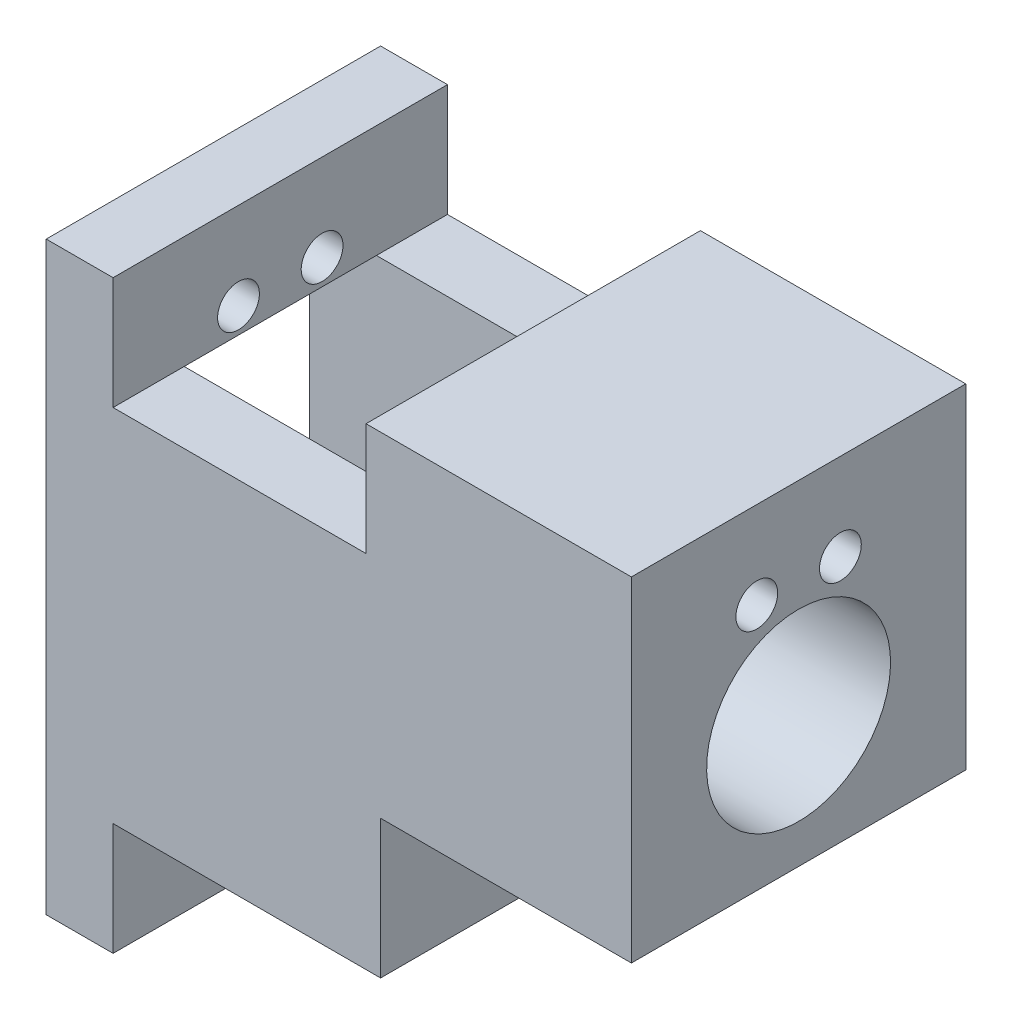
ISO-10303-21;
HEADER;
FILE_DESCRIPTION(('STEP AP214'),'2;1');
FILE_NAME('part.step','',(''),(''),'','','');
FILE_SCHEMA(('AUTOMOTIVE_DESIGN { 1 0 10303 214 1 1 1 1 }'));
ENDSEC;
DATA;
#1=APPLICATION_CONTEXT('core data for automotive mechanical design processes');
#2=APPLICATION_PROTOCOL_DEFINITION('international standard','automotive_design',2000,#1);
#3=PRODUCT_CONTEXT('',#1,'mechanical');
#4=PRODUCT('Part','Part','',(#3));
#5=PRODUCT_RELATED_PRODUCT_CATEGORY('part','',(#4));
#6=PRODUCT_DEFINITION_FORMATION('','',#4);
#7=PRODUCT_DEFINITION_CONTEXT('part definition',#1,'design');
#8=PRODUCT_DEFINITION('design','',#6,#7);
#9=PRODUCT_DEFINITION_SHAPE('','',#8);
#10=(LENGTH_UNIT() NAMED_UNIT(*) SI_UNIT(.MILLI.,.METRE.));
#11=(NAMED_UNIT(*) PLANE_ANGLE_UNIT() SI_UNIT($,.RADIAN.));
#12=(NAMED_UNIT(*) SI_UNIT($,.STERADIAN.) SOLID_ANGLE_UNIT());
#13=UNCERTAINTY_MEASURE_WITH_UNIT(LENGTH_MEASURE(1.E-05),#10,'distance_accuracy_value','');
#14=(GEOMETRIC_REPRESENTATION_CONTEXT(3) GLOBAL_UNCERTAINTY_ASSIGNED_CONTEXT((#13)) GLOBAL_UNIT_ASSIGNED_CONTEXT((#10,
#11,#12)) REPRESENTATION_CONTEXT('',''));
#15=CARTESIAN_POINT('',(0.,0.,0.));
#16=DIRECTION('',(0.,0.,1.));
#17=DIRECTION('',(1.,0.,0.));
#18=AXIS2_PLACEMENT_3D('',#15,#16,#17);
#19=CARTESIAN_POINT('',(-30.,-70.,40.));
#20=DIRECTION('',(-1.,0.,0.));
#21=DIRECTION('',(0.,0.,1.));
#22=AXIS2_PLACEMENT_3D('',#19,#20,#21);
#23=PLANE('',#22);
#24=DIRECTION('',(0.,0.,1.));
#25=VECTOR('',#24,1.);
#26=CARTESIAN_POINT('',(-30.,-56.55,0.));
#27=LINE('',#26,#25);
#28=CARTESIAN_POINT('',(-30.,-56.55,0.));
#29=VERTEX_POINT('',#28);
#30=CARTESIAN_POINT('',(-30.,-56.55,40.));
#31=VERTEX_POINT('',#30);
#32=EDGE_CURVE('E185',#29,#31,#27,.T.);
#33=ORIENTED_EDGE('',*,*,#32,.F.);
#34=DIRECTION('',(0.,1.,0.));
#35=VECTOR('',#34,1.);
#36=CARTESIAN_POINT('',(-30.,-70.,0.));
#37=LINE('',#36,#35);
#38=CARTESIAN_POINT('',(-30.,-40.,0.));
#39=VERTEX_POINT('',#38);
#40=EDGE_CURVE('E292',#29,#39,#37,.T.);
#41=ORIENTED_EDGE('',*,*,#40,.T.);
#42=DIRECTION('',(0.,0.,-1.));
#43=VECTOR('',#42,1.);
#44=CARTESIAN_POINT('',(-30.,-40.,40.));
#45=LINE('',#44,#43);
#46=CARTESIAN_POINT('',(-30.,-40.,40.));
#47=VERTEX_POINT('',#46);
#48=EDGE_CURVE('E297',#47,#39,#45,.T.);
#49=ORIENTED_EDGE('',*,*,#48,.F.);
#50=DIRECTION('',(0.,1.,0.));
#51=VECTOR('',#50,1.);
#52=CARTESIAN_POINT('',(-30.,-70.,40.));
#53=LINE('',#52,#51);
#54=EDGE_CURVE('E276',#31,#47,#53,.T.);
#55=ORIENTED_EDGE('',*,*,#54,.F.);
#56=EDGE_LOOP('',(#33,#41,#49,#55));
#57=FACE_BOUND('',#56,.T.);
#58=ADVANCED_FACE('F40',(#57),#23,.F.);
#59=CARTESIAN_POINT('',(-40.,0.,0.));
#60=DIRECTION('',(-1.,0.,0.));
#61=DIRECTION('',(0.,-1.,0.));
#62=AXIS2_PLACEMENT_3D('',#59,#60,#61);
#63=PLANE('',#62);
#64=DIRECTION('',(0.,1.,0.));
#65=VECTOR('',#64,1.);
#66=CARTESIAN_POINT('',(-40.,0.,8.5));
#67=LINE('',#66,#65);
#68=CARTESIAN_POINT('',(-40.,-56.55,8.5));
#69=VERTEX_POINT('',#68);
#70=CARTESIAN_POINT('',(-40.,-13.45,8.5));
#71=VERTEX_POINT('',#70);
#72=EDGE_CURVE('E241',#69,#71,#67,.T.);
#73=ORIENTED_EDGE('',*,*,#72,.F.);
#74=DIRECTION('',(0.,0.,1.));
#75=VECTOR('',#74,1.);
#76=CARTESIAN_POINT('',(-40.,-56.55,0.));
#77=LINE('',#76,#75);
#78=CARTESIAN_POINT('',(-40.,-56.55,31.5));
#79=VERTEX_POINT('',#78);
#80=EDGE_CURVE('E49',#69,#79,#77,.T.);
#81=ORIENTED_EDGE('',*,*,#80,.T.);
#82=DIRECTION('',(0.,1.,0.));
#83=VECTOR('',#82,1.);
#84=CARTESIAN_POINT('',(-40.,0.,31.5));
#85=LINE('',#84,#83);
#86=CARTESIAN_POINT('',(-40.,-13.45,31.5));
#87=VERTEX_POINT('',#86);
#88=EDGE_CURVE('E235',#79,#87,#85,.T.);
#89=ORIENTED_EDGE('',*,*,#88,.T.);
#90=DIRECTION('',(0.,0.,1.));
#91=VECTOR('',#90,1.);
#92=CARTESIAN_POINT('',(-40.,-13.45,0.));
#93=LINE('',#92,#91);
#94=EDGE_CURVE('E237',#71,#87,#93,.T.);
#95=ORIENTED_EDGE('',*,*,#94,.F.);
#96=EDGE_LOOP('',(#73,#81,#89,#95));
#97=FACE_BOUND('',#96,.T.);
#98=ADVANCED_FACE('F390',(#97),#63,.T.);
#99=CARTESIAN_POINT('',(0.,0.,40.));
#100=DIRECTION('',(0.,-1.,0.));
#101=DIRECTION('',(1.,0.,0.));
#102=AXIS2_PLACEMENT_3D('',#99,#100,#101);
#103=PLANE('',#102);
#104=DIRECTION('',(-1.,0.,0.));
#105=VECTOR('',#104,1.);
#106=CARTESIAN_POINT('',(0.,0.,40.));
#107=LINE('',#106,#105);
#108=CARTESIAN_POINT('',(-62.,0.,40.));
#109=VERTEX_POINT('',#108);
#110=CARTESIAN_POINT('',(-70.,0.,40.));
#111=VERTEX_POINT('',#110);
#112=EDGE_CURVE('E268',#109,#111,#107,.T.);
#113=ORIENTED_EDGE('',*,*,#112,.F.);
#114=DIRECTION('',(0.,0.,1.));
#115=VECTOR('',#114,1.);
#116=CARTESIAN_POINT('',(-62.,0.,0.));
#117=LINE('',#116,#115);
#118=CARTESIAN_POINT('',(-62.,0.,0.));
#119=VERTEX_POINT('',#118);
#120=EDGE_CURVE('E213',#119,#109,#117,.T.);
#121=ORIENTED_EDGE('',*,*,#120,.F.);
#122=DIRECTION('',(-1.,0.,0.));
#123=VECTOR('',#122,1.);
#124=CARTESIAN_POINT('',(0.,0.,0.));
#125=LINE('',#124,#123);
#126=CARTESIAN_POINT('',(-70.,0.,0.));
#127=VERTEX_POINT('',#126);
#128=EDGE_CURVE('E283',#119,#127,#125,.T.);
#129=ORIENTED_EDGE('',*,*,#128,.T.);
#130=DIRECTION('',(0.,0.,-1.));
#131=VECTOR('',#130,1.);
#132=CARTESIAN_POINT('',(-70.,0.,40.));
#133=LINE('',#132,#131);
#134=EDGE_CURVE('E303',#111,#127,#133,.T.);
#135=ORIENTED_EDGE('',*,*,#134,.F.);
#136=EDGE_LOOP('',(#113,#121,#129,#135));
#137=FACE_BOUND('',#136,.T.);
#138=ADVANCED_FACE('F356',(#137),#103,.F.);
#139=CARTESIAN_POINT('',(0.,-40.,40.));
#140=DIRECTION('',(-1.,0.,0.));
#141=DIRECTION('',(0.,-1.,0.));
#142=AXIS2_PLACEMENT_3D('',#139,#140,#141);
#143=PLANE('',#142);
#144=CARTESIAN_POINT('',(0.,-24.34,20.));
#145=DIRECTION('',(1.,0.,0.));
#146=DIRECTION('',(0.,1.,0.));
#147=AXIS2_PLACEMENT_3D('',#144,#145,#146);
#148=CIRCLE('',#147,11.);
#149=CARTESIAN_POINT('',(0.,-13.34,20.));
#150=VERTEX_POINT('',#149);
#151=EDGE_CURVE('E595',#150,#150,#148,.T.);
#152=ORIENTED_EDGE('',*,*,#151,.F.);
#153=EDGE_LOOP('',(#152));
#154=FACE_BOUND('',#153,.T.);
#155=CARTESIAN_POINT('',(0.,-10.4,15.));
#156=DIRECTION('',(-1.,0.,0.));
#157=DIRECTION('',(0.,-1.,0.));
#158=AXIS2_PLACEMENT_3D('',#155,#156,#157);
#159=CIRCLE('',#158,2.5);
#160=CARTESIAN_POINT('',(0.,-12.9,15.));
#161=VERTEX_POINT('',#160);
#162=EDGE_CURVE('E334',#161,#161,#159,.T.);
#163=ORIENTED_EDGE('',*,*,#162,.T.);
#164=EDGE_LOOP('',(#163));
#165=FACE_BOUND('',#164,.T.);
#166=CARTESIAN_POINT('',(0.,-10.4,25.));
#167=DIRECTION('',(-1.,0.,0.));
#168=DIRECTION('',(0.,-1.,0.));
#169=AXIS2_PLACEMENT_3D('',#166,#167,#168);
#170=CIRCLE('',#169,2.5);
#171=CARTESIAN_POINT('',(0.,-12.9,25.));
#172=VERTEX_POINT('',#171);
#173=EDGE_CURVE('E322',#172,#172,#170,.T.);
#174=ORIENTED_EDGE('',*,*,#173,.T.);
#175=EDGE_LOOP('',(#174));
#176=FACE_BOUND('',#175,.T.);
#177=DIRECTION('',(0.,1.,0.));
#178=VECTOR('',#177,1.);
#179=CARTESIAN_POINT('',(0.,-40.,0.));
#180=LINE('',#179,#178);
#181=CARTESIAN_POINT('',(0.,-40.,0.));
#182=VERTEX_POINT('',#181);
#183=CARTESIAN_POINT('',(0.,0.,0.));
#184=VERTEX_POINT('',#183);
#185=EDGE_CURVE('E256',#182,#184,#180,.T.);
#186=ORIENTED_EDGE('',*,*,#185,.T.);
#187=DIRECTION('',(0.,0.,-1.));
#188=VECTOR('',#187,1.);
#189=CARTESIAN_POINT('',(0.,0.,40.));
#190=LINE('',#189,#188);
#191=CARTESIAN_POINT('',(0.,0.,40.));
#192=VERTEX_POINT('',#191);
#193=EDGE_CURVE('E306',#192,#184,#190,.T.);
#194=ORIENTED_EDGE('',*,*,#193,.F.);
#195=DIRECTION('',(0.,1.,0.));
#196=VECTOR('',#195,1.);
#197=CARTESIAN_POINT('',(0.,-40.,40.));
#198=LINE('',#197,#196);
#199=CARTESIAN_POINT('',(0.,-40.,40.));
#200=VERTEX_POINT('',#199);
#201=EDGE_CURVE('E265',#200,#192,#198,.T.);
#202=ORIENTED_EDGE('',*,*,#201,.F.);
#203=DIRECTION('',(0.,0.,-1.));
#204=VECTOR('',#203,1.);
#205=CARTESIAN_POINT('',(0.,-40.,40.));
#206=LINE('',#205,#204);
#207=EDGE_CURVE('E280',#200,#182,#206,.T.);
#208=ORIENTED_EDGE('',*,*,#207,.T.);
#209=EDGE_LOOP('',(#186,#194,#202,#208));
#210=FACE_BOUND('',#209,.T.);
#211=ADVANCED_FACE('F42',(#154,#165,#176,#210),#143,.F.);
#212=CARTESIAN_POINT('',(-31.745166071012,0.,0.));
#213=VERTEX_POINT('',#212);
#214=EDGE_CURVE('E284',#184,#213,#125,.T.);
#215=ORIENTED_EDGE('',*,*,#214,.T.);
#216=DIRECTION('',(0.,0.,-1.));
#217=VECTOR('',#216,1.);
#218=CARTESIAN_POINT('',(-31.745166071012,0.,0.));
#219=LINE('',#218,#217);
#220=CARTESIAN_POINT('',(-31.745166071012,0.,40.));
#221=VERTEX_POINT('',#220);
#222=EDGE_CURVE('E208',#221,#213,#219,.T.);
#223=ORIENTED_EDGE('',*,*,#222,.F.);
#224=EDGE_CURVE('E270',#192,#221,#107,.T.);
#225=ORIENTED_EDGE('',*,*,#224,.F.);
#226=ORIENTED_EDGE('',*,*,#193,.T.);
#227=EDGE_LOOP('',(#215,#223,#225,#226));
#228=FACE_BOUND('',#227,.T.);
#229=ADVANCED_FACE('F406',(#228),#103,.F.);
#230=CARTESIAN_POINT('',(-70.,0.,40.));
#231=DIRECTION('',(1.,0.,0.));
#232=DIRECTION('',(0.,1.,0.));
#233=AXIS2_PLACEMENT_3D('',#230,#231,#232);
#234=PLANE('',#233);
#235=CARTESIAN_POINT('',(-70.,-10.4,15.));
#236=DIRECTION('',(-1.,0.,0.));
#237=DIRECTION('',(0.,-1.,0.));
#238=AXIS2_PLACEMENT_3D('',#235,#236,#237);
#239=CIRCLE('',#238,2.5);
#240=CARTESIAN_POINT('',(-70.,-12.9,15.));
#241=VERTEX_POINT('',#240);
#242=EDGE_CURVE('E603',#241,#241,#239,.T.);
#243=ORIENTED_EDGE('',*,*,#242,.F.);
#244=EDGE_LOOP('',(#243));
#245=FACE_BOUND('',#244,.T.);
#246=CARTESIAN_POINT('',(-70.,-60.5,25.));
#247=DIRECTION('',(-1.,0.,0.));
#248=DIRECTION('',(0.,-1.,0.));
#249=AXIS2_PLACEMENT_3D('',#246,#247,#248);
#250=CIRCLE('',#249,2.5);
#251=CARTESIAN_POINT('',(-70.,-63.,25.));
#252=VERTEX_POINT('',#251);
#253=EDGE_CURVE('E598',#252,#252,#250,.T.);
#254=ORIENTED_EDGE('',*,*,#253,.F.);
#255=EDGE_LOOP('',(#254));
#256=FACE_BOUND('',#255,.T.);
#257=CARTESIAN_POINT('',(-70.,-60.5,15.));
#258=DIRECTION('',(-1.,0.,0.));
#259=DIRECTION('',(0.,-1.,0.));
#260=AXIS2_PLACEMENT_3D('',#257,#258,#259);
#261=CIRCLE('',#260,2.5);
#262=CARTESIAN_POINT('',(-70.,-63.,15.));
#263=VERTEX_POINT('',#262);
#264=EDGE_CURVE('E594',#263,#263,#261,.T.);
#265=ORIENTED_EDGE('',*,*,#264,.F.);
#266=EDGE_LOOP('',(#265));
#267=FACE_BOUND('',#266,.T.);
#268=CARTESIAN_POINT('',(-70.,-10.4,25.));
#269=DIRECTION('',(-1.,0.,0.));
#270=DIRECTION('',(0.,-1.,0.));
#271=AXIS2_PLACEMENT_3D('',#268,#269,#270);
#272=CIRCLE('',#271,2.5);
#273=CARTESIAN_POINT('',(-70.,-12.9,25.));
#274=VERTEX_POINT('',#273);
#275=EDGE_CURVE('E314',#274,#274,#272,.T.);
#276=ORIENTED_EDGE('',*,*,#275,.F.);
#277=EDGE_LOOP('',(#276));
#278=FACE_BOUND('',#277,.T.);
#279=DIRECTION('',(0.,1.,0.));
#280=VECTOR('',#279,1.);
#281=CARTESIAN_POINT('',(-70.,0.,31.5));
#282=LINE('',#281,#280);
#283=CARTESIAN_POINT('',(-70.,-57.45,31.5));
#284=VERTEX_POINT('',#283);
#285=CARTESIAN_POINT('',(-70.,-13.45,31.5));
#286=VERTEX_POINT('',#285);
#287=EDGE_CURVE('E246',#284,#286,#282,.T.);
#288=ORIENTED_EDGE('',*,*,#287,.F.);
#289=DIRECTION('',(0.,0.,1.));
#290=VECTOR('',#289,1.);
#291=CARTESIAN_POINT('',(-70.,-57.45,0.));
#292=LINE('',#291,#290);
#293=CARTESIAN_POINT('',(-70.,-57.45,8.5));
#294=VERTEX_POINT('',#293);
#295=EDGE_CURVE('E228',#294,#284,#292,.T.);
#296=ORIENTED_EDGE('',*,*,#295,.F.);
#297=DIRECTION('',(0.,1.,0.));
#298=VECTOR('',#297,1.);
#299=CARTESIAN_POINT('',(-70.,0.,8.5));
#300=LINE('',#299,#298);
#301=CARTESIAN_POINT('',(-70.,-13.45,8.5));
#302=VERTEX_POINT('',#301);
#303=EDGE_CURVE('E238',#294,#302,#300,.T.);
#304=ORIENTED_EDGE('',*,*,#303,.T.);
#305=DIRECTION('',(0.,0.,1.));
#306=VECTOR('',#305,1.);
#307=CARTESIAN_POINT('',(-70.,-13.45,0.));
#308=LINE('',#307,#306);
#309=EDGE_CURVE('E249',#302,#286,#308,.T.);
#310=ORIENTED_EDGE('',*,*,#309,.T.);
#311=EDGE_LOOP('',(#288,#296,#304,#310));
#312=FACE_BOUND('',#311,.T.);
#313=DIRECTION('',(0.,-1.,0.));
#314=VECTOR('',#313,1.);
#315=CARTESIAN_POINT('',(-70.,0.,0.));
#316=LINE('',#315,#314);
#317=CARTESIAN_POINT('',(-70.,-70.,0.));
#318=VERTEX_POINT('',#317);
#319=EDGE_CURVE('E287',#127,#318,#316,.T.);
#320=ORIENTED_EDGE('',*,*,#319,.T.);
#321=DIRECTION('',(0.,0.,-1.));
#322=VECTOR('',#321,1.);
#323=CARTESIAN_POINT('',(-70.,-70.,40.));
#324=LINE('',#323,#322);
#325=CARTESIAN_POINT('',(-70.,-70.,40.));
#326=VERTEX_POINT('',#325);
#327=EDGE_CURVE('E300',#326,#318,#324,.T.);
#328=ORIENTED_EDGE('',*,*,#327,.F.);
#329=DIRECTION('',(0.,-1.,0.));
#330=VECTOR('',#329,1.);
#331=CARTESIAN_POINT('',(-70.,0.,40.));
#332=LINE('',#331,#330);
#333=EDGE_CURVE('E273',#111,#326,#332,.T.);
#334=ORIENTED_EDGE('',*,*,#333,.F.);
#335=ORIENTED_EDGE('',*,*,#134,.T.);
#336=EDGE_LOOP('',(#320,#328,#334,#335));
#337=FACE_BOUND('',#336,.T.);
#338=ADVANCED_FACE('F348',(#245,#256,#267,#278,#312,#337),#234,.F.);
#339=CARTESIAN_POINT('',(-70.,-70.,40.));
#340=DIRECTION('',(0.,1.,0.));
#341=DIRECTION('',(-1.,0.,0.));
#342=AXIS2_PLACEMENT_3D('',#339,#340,#341);
#343=PLANE('',#342);
#344=DIRECTION('',(1.,0.,0.));
#345=VECTOR('',#344,1.);
#346=CARTESIAN_POINT('',(-70.,-70.,0.));
#347=LINE('',#346,#345);
#348=CARTESIAN_POINT('',(-62.,-70.,0.));
#349=VERTEX_POINT('',#348);
#350=EDGE_CURVE('E289',#318,#349,#347,.T.);
#351=ORIENTED_EDGE('',*,*,#350,.T.);
#352=DIRECTION('',(0.,0.,-1.));
#353=VECTOR('',#352,1.);
#354=CARTESIAN_POINT('',(-62.,-70.,0.));
#355=LINE('',#354,#353);
#356=CARTESIAN_POINT('',(-62.,-70.,40.));
#357=VERTEX_POINT('',#356);
#358=EDGE_CURVE('E188',#357,#349,#355,.T.);
#359=ORIENTED_EDGE('',*,*,#358,.F.);
#360=DIRECTION('',(1.,0.,0.));
#361=VECTOR('',#360,1.);
#362=CARTESIAN_POINT('',(-70.,-70.,40.));
#363=LINE('',#362,#361);
#364=EDGE_CURVE('E193',#326,#357,#363,.T.);
#365=ORIENTED_EDGE('',*,*,#364,.F.);
#366=ORIENTED_EDGE('',*,*,#327,.T.);
#367=EDGE_LOOP('',(#351,#359,#365,#366));
#368=FACE_BOUND('',#367,.T.);
#369=ADVANCED_FACE('F344',(#368),#343,.F.);
#370=CARTESIAN_POINT('',(-30.,-40.,40.));
#371=DIRECTION('',(0.,1.,0.));
#372=DIRECTION('',(-1.,0.,0.));
#373=AXIS2_PLACEMENT_3D('',#370,#371,#372);
#374=PLANE('',#373);
#375=DIRECTION('',(1.,0.,0.));
#376=VECTOR('',#375,1.);
#377=CARTESIAN_POINT('',(-30.,-40.,0.));
#378=LINE('',#377,#376);
#379=EDGE_CURVE('E269',#39,#182,#378,.T.);
#380=ORIENTED_EDGE('',*,*,#379,.T.);
#381=ORIENTED_EDGE('',*,*,#207,.F.);
#382=DIRECTION('',(1.,0.,0.));
#383=VECTOR('',#382,1.);
#384=CARTESIAN_POINT('',(-30.,-40.,40.));
#385=LINE('',#384,#383);
#386=EDGE_CURVE('E278',#47,#200,#385,.T.);
#387=ORIENTED_EDGE('',*,*,#386,.F.);
#388=ORIENTED_EDGE('',*,*,#48,.T.);
#389=EDGE_LOOP('',(#380,#381,#387,#388));
#390=FACE_BOUND('',#389,.T.);
#391=ADVANCED_FACE('F399',(#390),#374,.F.);
#392=CARTESIAN_POINT('',(0.,0.,40.));
#393=DIRECTION('',(0.,0.,1.));
#394=DIRECTION('',(1.,0.,0.));
#395=AXIS2_PLACEMENT_3D('',#392,#393,#394);
#396=PLANE('',#395);
#397=DIRECTION('',(0.,-1.,0.));
#398=VECTOR('',#397,1.);
#399=CARTESIAN_POINT('',(-62.,-56.55,40.));
#400=LINE('',#399,#398);
#401=CARTESIAN_POINT('',(-62.,-56.55,40.));
#402=VERTEX_POINT('',#401);
#403=EDGE_CURVE('E176',#402,#357,#400,.T.);
#404=ORIENTED_EDGE('',*,*,#403,.F.);
#405=DIRECTION('',(-1.,0.,0.));
#406=VECTOR('',#405,1.);
#407=CARTESIAN_POINT('',(0.,-56.5499999999999,40.));
#408=LINE('',#407,#406);
#409=EDGE_CURVE('E182',#31,#402,#408,.T.);
#410=ORIENTED_EDGE('',*,*,#409,.F.);
#411=ORIENTED_EDGE('',*,*,#54,.T.);
#412=ORIENTED_EDGE('',*,*,#386,.T.);
#413=ORIENTED_EDGE('',*,*,#201,.T.);
#414=ORIENTED_EDGE('',*,*,#224,.T.);
#415=DIRECTION('',(0.,1.,0.));
#416=VECTOR('',#415,1.);
#417=CARTESIAN_POINT('',(-31.745166071012,-13.45,40.));
#418=LINE('',#417,#416);
#419=CARTESIAN_POINT('',(-31.745166071012,-13.45,40.));
#420=VERTEX_POINT('',#419);
#421=EDGE_CURVE('E221',#420,#221,#418,.T.);
#422=ORIENTED_EDGE('',*,*,#421,.F.);
#423=DIRECTION('',(1.,0.,0.));
#424=VECTOR('',#423,1.);
#425=CARTESIAN_POINT('',(0.,-13.45,40.));
#426=LINE('',#425,#424);
#427=CARTESIAN_POINT('',(-62.,-13.45,40.));
#428=VERTEX_POINT('',#427);
#429=EDGE_CURVE('E209',#428,#420,#426,.T.);
#430=ORIENTED_EDGE('',*,*,#429,.F.);
#431=DIRECTION('',(0.,1.,0.));
#432=VECTOR('',#431,1.);
#433=CARTESIAN_POINT('',(-62.,-13.45,40.));
#434=LINE('',#433,#432);
#435=EDGE_CURVE('E225',#428,#109,#434,.T.);
#436=ORIENTED_EDGE('',*,*,#435,.T.);
#437=ORIENTED_EDGE('',*,*,#112,.T.);
#438=ORIENTED_EDGE('',*,*,#333,.T.);
#439=ORIENTED_EDGE('',*,*,#364,.T.);
#440=EDGE_LOOP('',(#404,#410,#411,#412,#413,#414,#422,#430,#436,#437,#438,#439));
#441=FACE_BOUND('',#440,.T.);
#442=ADVANCED_FACE('F191',(#441),#396,.T.);
#443=CARTESIAN_POINT('',(0.,0.,0.));
#444=DIRECTION('',(0.,0.,1.));
#445=DIRECTION('',(1.,0.,0.));
#446=AXIS2_PLACEMENT_3D('',#443,#444,#445);
#447=PLANE('',#446);
#448=DIRECTION('',(1.,0.,0.));
#449=VECTOR('',#448,1.);
#450=CARTESIAN_POINT('',(0.,-56.5499999999999,0.));
#451=LINE('',#450,#449);
#452=CARTESIAN_POINT('',(-62.,-56.55,0.));
#453=VERTEX_POINT('',#452);
#454=EDGE_CURVE('E178',#453,#29,#451,.T.);
#455=ORIENTED_EDGE('',*,*,#454,.F.);
#456=DIRECTION('',(0.,-1.,0.));
#457=VECTOR('',#456,1.);
#458=CARTESIAN_POINT('',(-62.,-56.55,0.));
#459=LINE('',#458,#457);
#460=EDGE_CURVE('E57',#453,#349,#459,.T.);
#461=ORIENTED_EDGE('',*,*,#460,.T.);
#462=ORIENTED_EDGE('',*,*,#350,.F.);
#463=ORIENTED_EDGE('',*,*,#319,.F.);
#464=ORIENTED_EDGE('',*,*,#128,.F.);
#465=DIRECTION('',(0.,1.,0.));
#466=VECTOR('',#465,1.);
#467=CARTESIAN_POINT('',(-62.,-13.45,0.));
#468=LINE('',#467,#466);
#469=CARTESIAN_POINT('',(-62.,-13.45,0.));
#470=VERTEX_POINT('',#469);
#471=EDGE_CURVE('E229',#470,#119,#468,.T.);
#472=ORIENTED_EDGE('',*,*,#471,.F.);
#473=DIRECTION('',(-1.,0.,0.));
#474=VECTOR('',#473,1.);
#475=CARTESIAN_POINT('',(0.,-13.45,0.));
#476=LINE('',#475,#474);
#477=CARTESIAN_POINT('',(-31.745166071012,-13.45,0.));
#478=VERTEX_POINT('',#477);
#479=EDGE_CURVE('E215',#478,#470,#476,.T.);
#480=ORIENTED_EDGE('',*,*,#479,.F.);
#481=DIRECTION('',(0.,1.,0.));
#482=VECTOR('',#481,1.);
#483=CARTESIAN_POINT('',(-31.745166071012,-13.45,0.));
#484=LINE('',#483,#482);
#485=EDGE_CURVE('E231',#478,#213,#484,.T.);
#486=ORIENTED_EDGE('',*,*,#485,.T.);
#487=ORIENTED_EDGE('',*,*,#214,.F.);
#488=ORIENTED_EDGE('',*,*,#185,.F.);
#489=ORIENTED_EDGE('',*,*,#379,.F.);
#490=ORIENTED_EDGE('',*,*,#40,.F.);
#491=EDGE_LOOP('',(#455,#461,#462,#463,#464,#472,#480,#486,#487,#488,#489,#490));
#492=FACE_BOUND('',#491,.T.);
#493=ADVANCED_FACE('F341',(#492),#447,.F.);
#494=CARTESIAN_POINT('',(-40.,-57.45,0.));
#495=DIRECTION('',(0.,-1.,0.));
#496=DIRECTION('',(1.,0.,0.));
#497=AXIS2_PLACEMENT_3D('',#494,#495,#496);
#498=PLANE('',#497);
#499=DIRECTION('',(-1.,0.,0.));
#500=VECTOR('',#499,1.);
#501=CARTESIAN_POINT('',(-40.,-57.45,31.5));
#502=LINE('',#501,#500);
#503=CARTESIAN_POINT('',(-62.,-57.45,31.5));
#504=VERTEX_POINT('',#503);
#505=EDGE_CURVE('E243',#504,#284,#502,.T.);
#506=ORIENTED_EDGE('',*,*,#505,.F.);
#507=DIRECTION('',(0.,0.,-1.));
#508=VECTOR('',#507,1.);
#509=CARTESIAN_POINT('',(-62.,-57.45,0.));
#510=LINE('',#509,#508);
#511=CARTESIAN_POINT('',(-62.,-57.45,8.5));
#512=VERTEX_POINT('',#511);
#513=EDGE_CURVE('E203',#504,#512,#510,.T.);
#514=ORIENTED_EDGE('',*,*,#513,.T.);
#515=DIRECTION('',(-1.,0.,0.));
#516=VECTOR('',#515,1.);
#517=CARTESIAN_POINT('',(-40.,-57.45,8.5));
#518=LINE('',#517,#516);
#519=EDGE_CURVE('E254',#512,#294,#518,.T.);
#520=ORIENTED_EDGE('',*,*,#519,.T.);
#521=ORIENTED_EDGE('',*,*,#295,.T.);
#522=EDGE_LOOP('',(#506,#514,#520,#521));
#523=FACE_BOUND('',#522,.T.);
#524=ADVANCED_FACE('F392',(#523),#498,.F.);
#525=CARTESIAN_POINT('',(-40.,0.,8.5));
#526=DIRECTION('',(0.,0.,1.));
#527=DIRECTION('',(1.,0.,0.));
#528=AXIS2_PLACEMENT_3D('',#525,#526,#527);
#529=PLANE('',#528);
#530=DIRECTION('',(0.,-1.,0.));
#531=VECTOR('',#530,1.);
#532=CARTESIAN_POINT('',(-62.0000000000001,0.,8.5));
#533=LINE('',#532,#531);
#534=CARTESIAN_POINT('',(-62.,-56.55,8.5));
#535=VERTEX_POINT('',#534);
#536=EDGE_CURVE('E206',#535,#512,#533,.T.);
#537=ORIENTED_EDGE('',*,*,#536,.F.);
#538=DIRECTION('',(1.,0.,0.));
#539=VECTOR('',#538,1.);
#540=CARTESIAN_POINT('',(-40.,-56.55,8.5));
#541=LINE('',#540,#539);
#542=EDGE_CURVE('E200',#535,#69,#541,.T.);
#543=ORIENTED_EDGE('',*,*,#542,.T.);
#544=ORIENTED_EDGE('',*,*,#72,.T.);
#545=DIRECTION('',(-1.,0.,0.));
#546=VECTOR('',#545,1.);
#547=CARTESIAN_POINT('',(-40.,-13.45,8.5));
#548=LINE('',#547,#546);
#549=CARTESIAN_POINT('',(-62.,-13.45,8.5));
#550=VERTEX_POINT('',#549);
#551=EDGE_CURVE('E257',#71,#550,#548,.T.);
#552=ORIENTED_EDGE('',*,*,#551,.T.);
#553=EDGE_CURVE('E260',#550,#302,#548,.T.);
#554=ORIENTED_EDGE('',*,*,#553,.T.);
#555=ORIENTED_EDGE('',*,*,#303,.F.);
#556=ORIENTED_EDGE('',*,*,#519,.F.);
#557=EDGE_LOOP('',(#537,#543,#544,#552,#554,#555,#556));
#558=FACE_BOUND('',#557,.T.);
#559=ADVANCED_FACE('F385',(#558),#529,.T.);
#560=CARTESIAN_POINT('',(-40.,-13.45,0.));
#561=DIRECTION('',(0.,-1.,0.));
#562=DIRECTION('',(1.,0.,0.));
#563=AXIS2_PLACEMENT_3D('',#560,#561,#562);
#564=PLANE('',#563);
#565=DIRECTION('',(0.,0.,1.));
#566=VECTOR('',#565,1.);
#567=CARTESIAN_POINT('',(-62.,-13.45,0.));
#568=LINE('',#567,#566);
#569=CARTESIAN_POINT('',(-62.,-13.45,31.5));
#570=VERTEX_POINT('',#569);
#571=EDGE_CURVE('E222',#550,#570,#568,.T.);
#572=ORIENTED_EDGE('',*,*,#571,.T.);
#573=DIRECTION('',(-1.,0.,0.));
#574=VECTOR('',#573,1.);
#575=CARTESIAN_POINT('',(-40.,-13.45,31.5));
#576=LINE('',#575,#574);
#577=EDGE_CURVE('E263',#570,#286,#576,.T.);
#578=ORIENTED_EDGE('',*,*,#577,.T.);
#579=ORIENTED_EDGE('',*,*,#309,.F.);
#580=ORIENTED_EDGE('',*,*,#553,.F.);
#581=EDGE_LOOP('',(#572,#578,#579,#580));
#582=FACE_BOUND('',#581,.T.);
#583=ADVANCED_FACE('F372',(#582),#564,.T.);
#584=CARTESIAN_POINT('',(-40.,0.,31.5));
#585=DIRECTION('',(0.,0.,1.));
#586=DIRECTION('',(1.,0.,0.));
#587=AXIS2_PLACEMENT_3D('',#584,#585,#586);
#588=PLANE('',#587);
#589=DIRECTION('',(1.,0.,0.));
#590=VECTOR('',#589,1.);
#591=CARTESIAN_POINT('',(-40.,-56.55,31.5));
#592=LINE('',#591,#590);
#593=CARTESIAN_POINT('',(-62.,-56.55,31.5));
#594=VERTEX_POINT('',#593);
#595=EDGE_CURVE('E65',#594,#79,#592,.T.);
#596=ORIENTED_EDGE('',*,*,#595,.F.);
#597=DIRECTION('',(0.,-1.,0.));
#598=VECTOR('',#597,1.);
#599=CARTESIAN_POINT('',(-62.0000000000001,0.,31.5));
#600=LINE('',#599,#598);
#601=EDGE_CURVE('E12',#594,#504,#600,.T.);
#602=ORIENTED_EDGE('',*,*,#601,.T.);
#603=ORIENTED_EDGE('',*,*,#505,.T.);
#604=ORIENTED_EDGE('',*,*,#287,.T.);
#605=ORIENTED_EDGE('',*,*,#577,.F.);
#606=EDGE_CURVE('E261',#87,#570,#576,.T.);
#607=ORIENTED_EDGE('',*,*,#606,.F.);
#608=ORIENTED_EDGE('',*,*,#88,.F.);
#609=EDGE_LOOP('',(#596,#602,#603,#604,#605,#607,#608));
#610=FACE_BOUND('',#609,.T.);
#611=ADVANCED_FACE('F375',(#610),#588,.F.);
#612=CARTESIAN_POINT('',(-62.,-13.45,0.));
#613=DIRECTION('',(-1.,0.,0.));
#614=DIRECTION('',(0.,-1.,0.));
#615=AXIS2_PLACEMENT_3D('',#612,#613,#614);
#616=PLANE('',#615);
#617=CARTESIAN_POINT('',(-62.,-10.4,15.));
#618=DIRECTION('',(-1.,0.,0.));
#619=DIRECTION('',(0.,-1.,0.));
#620=AXIS2_PLACEMENT_3D('',#617,#618,#619);
#621=CIRCLE('',#620,2.5);
#622=CARTESIAN_POINT('',(-62.,-12.9,15.));
#623=VERTEX_POINT('',#622);
#624=EDGE_CURVE('E331',#623,#623,#621,.T.);
#625=ORIENTED_EDGE('',*,*,#624,.T.);
#626=EDGE_LOOP('',(#625));
#627=FACE_BOUND('',#626,.T.);
#628=CARTESIAN_POINT('',(-62.,-10.4,25.));
#629=DIRECTION('',(-1.,0.,0.));
#630=DIRECTION('',(0.,-1.,0.));
#631=AXIS2_PLACEMENT_3D('',#628,#629,#630);
#632=CIRCLE('',#631,2.5);
#633=CARTESIAN_POINT('',(-62.,-12.9,25.));
#634=VERTEX_POINT('',#633);
#635=EDGE_CURVE('E318',#634,#634,#632,.T.);
#636=ORIENTED_EDGE('',*,*,#635,.T.);
#637=EDGE_LOOP('',(#636));
#638=FACE_BOUND('',#637,.T.);
#639=ORIENTED_EDGE('',*,*,#120,.T.);
#640=ORIENTED_EDGE('',*,*,#435,.F.);
#641=EDGE_CURVE('E217',#570,#428,#568,.T.);
#642=ORIENTED_EDGE('',*,*,#641,.F.);
#643=ORIENTED_EDGE('',*,*,#571,.F.);
#644=EDGE_CURVE('E218',#470,#550,#568,.T.);
#645=ORIENTED_EDGE('',*,*,#644,.F.);
#646=ORIENTED_EDGE('',*,*,#471,.T.);
#647=EDGE_LOOP('',(#639,#640,#642,#643,#645,#646));
#648=FACE_BOUND('',#647,.T.);
#649=ADVANCED_FACE('F359',(#627,#638,#648),#616,.F.);
#650=CARTESIAN_POINT('',(-31.745166071012,-13.45,0.));
#651=DIRECTION('',(1.,0.,0.));
#652=DIRECTION('',(0.,1.,0.));
#653=AXIS2_PLACEMENT_3D('',#650,#651,#652);
#654=PLANE('',#653);
#655=CARTESIAN_POINT('',(-31.745166071012,-10.4,15.));
#656=DIRECTION('',(1.,0.,0.));
#657=DIRECTION('',(0.,1.,0.));
#658=AXIS2_PLACEMENT_3D('',#655,#656,#657);
#659=CIRCLE('',#658,2.5);
#660=CARTESIAN_POINT('',(-31.745166071012,-7.89999999999999,15.));
#661=VERTEX_POINT('',#660);
#662=EDGE_CURVE('E44',#661,#661,#659,.T.);
#663=ORIENTED_EDGE('',*,*,#662,.T.);
#664=EDGE_LOOP('',(#663));
#665=FACE_BOUND('',#664,.T.);
#666=CARTESIAN_POINT('',(-31.745166071012,-10.4,25.));
#667=DIRECTION('',(1.,0.,0.));
#668=DIRECTION('',(0.,1.,0.));
#669=AXIS2_PLACEMENT_3D('',#666,#667,#668);
#670=CIRCLE('',#669,2.5);
#671=CARTESIAN_POINT('',(-31.745166071012,-7.89999999999999,25.));
#672=VERTEX_POINT('',#671);
#673=EDGE_CURVE('E316',#672,#672,#670,.T.);
#674=ORIENTED_EDGE('',*,*,#673,.T.);
#675=EDGE_LOOP('',(#674));
#676=FACE_BOUND('',#675,.T.);
#677=ORIENTED_EDGE('',*,*,#222,.T.);
#678=ORIENTED_EDGE('',*,*,#485,.F.);
#679=DIRECTION('',(0.,0.,-1.));
#680=VECTOR('',#679,1.);
#681=CARTESIAN_POINT('',(-31.745166071012,-13.45,0.));
#682=LINE('',#681,#680);
#683=EDGE_CURVE('E212',#420,#478,#682,.T.);
#684=ORIENTED_EDGE('',*,*,#683,.F.);
#685=ORIENTED_EDGE('',*,*,#421,.T.);
#686=EDGE_LOOP('',(#677,#678,#684,#685));
#687=FACE_BOUND('',#686,.T.);
#688=ADVANCED_FACE('F408',(#665,#676,#687),#654,.F.);
#689=CARTESIAN_POINT('',(0.,-13.45,0.));
#690=DIRECTION('',(0.,1.,0.));
#691=DIRECTION('',(-1.,0.,0.));
#692=AXIS2_PLACEMENT_3D('',#689,#690,#691);
#693=PLANE('',#692);
#694=ORIENTED_EDGE('',*,*,#94,.T.);
#695=ORIENTED_EDGE('',*,*,#606,.T.);
#696=ORIENTED_EDGE('',*,*,#641,.T.);
#697=ORIENTED_EDGE('',*,*,#429,.T.);
#698=ORIENTED_EDGE('',*,*,#683,.T.);
#699=ORIENTED_EDGE('',*,*,#479,.T.);
#700=ORIENTED_EDGE('',*,*,#644,.T.);
#701=ORIENTED_EDGE('',*,*,#551,.F.);
#702=EDGE_LOOP('',(#694,#695,#696,#697,#698,#699,#700,#701));
#703=FACE_BOUND('',#702,.T.);
#704=ADVANCED_FACE('F365',(#703),#693,.T.);
#705=CARTESIAN_POINT('',(-62.,-56.55,0.));
#706=DIRECTION('',(-1.,0.,0.));
#707=DIRECTION('',(0.,-1.,0.));
#708=AXIS2_PLACEMENT_3D('',#705,#706,#707);
#709=PLANE('',#708);
#710=CARTESIAN_POINT('',(-62.,-60.5,25.));
#711=DIRECTION('',(-1.,0.,0.));
#712=DIRECTION('',(0.,-1.,0.));
#713=AXIS2_PLACEMENT_3D('',#710,#711,#712);
#714=CIRCLE('',#713,2.5);
#715=CARTESIAN_POINT('',(-62.,-63.,25.));
#716=VERTEX_POINT('',#715);
#717=EDGE_CURVE('E313',#716,#716,#714,.T.);
#718=ORIENTED_EDGE('',*,*,#717,.T.);
#719=EDGE_LOOP('',(#718));
#720=FACE_BOUND('',#719,.T.);
#721=CARTESIAN_POINT('',(-62.,-60.5,15.));
#722=DIRECTION('',(-1.,0.,0.));
#723=DIRECTION('',(0.,-1.,0.));
#724=AXIS2_PLACEMENT_3D('',#721,#722,#723);
#725=CIRCLE('',#724,2.5);
#726=CARTESIAN_POINT('',(-62.,-63.,15.));
#727=VERTEX_POINT('',#726);
#728=EDGE_CURVE('E310',#727,#727,#725,.T.);
#729=ORIENTED_EDGE('',*,*,#728,.T.);
#730=EDGE_LOOP('',(#729));
#731=FACE_BOUND('',#730,.T.);
#732=ORIENTED_EDGE('',*,*,#536,.T.);
#733=ORIENTED_EDGE('',*,*,#513,.F.);
#734=ORIENTED_EDGE('',*,*,#601,.F.);
#735=DIRECTION('',(0.,0.,-1.));
#736=VECTOR('',#735,1.);
#737=CARTESIAN_POINT('',(-62.,-56.55,0.));
#738=LINE('',#737,#736);
#739=EDGE_CURVE('E172',#402,#594,#738,.T.);
#740=ORIENTED_EDGE('',*,*,#739,.F.);
#741=ORIENTED_EDGE('',*,*,#403,.T.);
#742=ORIENTED_EDGE('',*,*,#358,.T.);
#743=ORIENTED_EDGE('',*,*,#460,.F.);
#744=EDGE_CURVE('E179',#535,#453,#738,.T.);
#745=ORIENTED_EDGE('',*,*,#744,.F.);
#746=EDGE_LOOP('',(#732,#733,#734,#740,#741,#742,#743,#745));
#747=FACE_BOUND('',#746,.T.);
#748=ADVANCED_FACE('F174',(#720,#731,#747),#709,.F.);
#749=CARTESIAN_POINT('',(0.,-56.5499999999999,0.));
#750=DIRECTION('',(0.,-1.,0.));
#751=DIRECTION('',(1.,0.,0.));
#752=AXIS2_PLACEMENT_3D('',#749,#750,#751);
#753=PLANE('',#752);
#754=ORIENTED_EDGE('',*,*,#744,.T.);
#755=ORIENTED_EDGE('',*,*,#454,.T.);
#756=ORIENTED_EDGE('',*,*,#32,.T.);
#757=ORIENTED_EDGE('',*,*,#409,.T.);
#758=ORIENTED_EDGE('',*,*,#739,.T.);
#759=ORIENTED_EDGE('',*,*,#595,.T.);
#760=ORIENTED_EDGE('',*,*,#80,.F.);
#761=ORIENTED_EDGE('',*,*,#542,.F.);
#762=EDGE_LOOP('',(#754,#755,#756,#757,#758,#759,#760,#761));
#763=FACE_BOUND('',#762,.T.);
#764=ADVANCED_FACE('F183',(#763),#753,.T.);
#765=CARTESIAN_POINT('',(30.,-60.5,15.));
#766=DIRECTION('',(-1.,0.,0.));
#767=DIRECTION('',(0.,-1.,0.));
#768=AXIS2_PLACEMENT_3D('',#765,#766,#767);
#769=CYLINDRICAL_SURFACE('',#768,2.5);
#770=ORIENTED_EDGE('',*,*,#264,.T.);
#771=EDGE_LOOP('',(#770));
#772=FACE_BOUND('',#771,.T.);
#773=ORIENTED_EDGE('',*,*,#728,.F.);
#774=EDGE_LOOP('',(#773));
#775=FACE_BOUND('',#774,.T.);
#776=ADVANCED_FACE('F492',(#772,#775),#769,.F.);
#777=CARTESIAN_POINT('',(30.,-60.5,25.));
#778=DIRECTION('',(-1.,0.,0.));
#779=DIRECTION('',(0.,-1.,0.));
#780=AXIS2_PLACEMENT_3D('',#777,#778,#779);
#781=CYLINDRICAL_SURFACE('',#780,2.5);
#782=ORIENTED_EDGE('',*,*,#253,.T.);
#783=EDGE_LOOP('',(#782));
#784=FACE_BOUND('',#783,.T.);
#785=ORIENTED_EDGE('',*,*,#717,.F.);
#786=EDGE_LOOP('',(#785));
#787=FACE_BOUND('',#786,.T.);
#788=ADVANCED_FACE('F527',(#784,#787),#781,.F.);
#789=CARTESIAN_POINT('',(30.,-10.4,25.));
#790=DIRECTION('',(-1.,0.,0.));
#791=DIRECTION('',(0.,-1.,0.));
#792=AXIS2_PLACEMENT_3D('',#789,#790,#791);
#793=CYLINDRICAL_SURFACE('',#792,2.5);
#794=ORIENTED_EDGE('',*,*,#673,.F.);
#795=EDGE_LOOP('',(#794));
#796=FACE_BOUND('',#795,.T.);
#797=ORIENTED_EDGE('',*,*,#173,.F.);
#798=EDGE_LOOP('',(#797));
#799=FACE_BOUND('',#798,.T.);
#800=ADVANCED_FACE('F535',(#796,#799),#793,.F.);
#801=CARTESIAN_POINT('',(30.,-10.4,15.));
#802=DIRECTION('',(-1.,0.,0.));
#803=DIRECTION('',(0.,-1.,0.));
#804=AXIS2_PLACEMENT_3D('',#801,#802,#803);
#805=CYLINDRICAL_SURFACE('',#804,2.5);
#806=ORIENTED_EDGE('',*,*,#662,.F.);
#807=EDGE_LOOP('',(#806));
#808=FACE_BOUND('',#807,.T.);
#809=ORIENTED_EDGE('',*,*,#162,.F.);
#810=EDGE_LOOP('',(#809));
#811=FACE_BOUND('',#810,.T.);
#812=ADVANCED_FACE('F543',(#808,#811),#805,.F.);
#813=ORIENTED_EDGE('',*,*,#275,.T.);
#814=EDGE_LOOP('',(#813));
#815=FACE_BOUND('',#814,.T.);
#816=ORIENTED_EDGE('',*,*,#635,.F.);
#817=EDGE_LOOP('',(#816));
#818=FACE_BOUND('',#817,.T.);
#819=ADVANCED_FACE('F546',(#815,#818),#793,.F.);
#820=ORIENTED_EDGE('',*,*,#242,.T.);
#821=EDGE_LOOP('',(#820));
#822=FACE_BOUND('',#821,.T.);
#823=ORIENTED_EDGE('',*,*,#624,.F.);
#824=EDGE_LOOP('',(#823));
#825=FACE_BOUND('',#824,.T.);
#826=ADVANCED_FACE('F554',(#822,#825),#805,.F.);
#827=CARTESIAN_POINT('',(-28.12,-24.3399999999999,20.));
#828=DIRECTION('',(1.,0.,0.));
#829=DIRECTION('',(0.,1.,0.));
#830=AXIS2_PLACEMENT_3D('',#827,#828,#829);
#831=CYLINDRICAL_SURFACE('',#830,11.);
#832=CARTESIAN_POINT('',(-28.12,-24.3399999999999,20.));
#833=DIRECTION('',(1.,0.,0.));
#834=DIRECTION('',(0.,1.,0.));
#835=AXIS2_PLACEMENT_3D('',#832,#833,#834);
#836=CIRCLE('',#835,11.);
#837=CARTESIAN_POINT('',(-28.12,-13.3399999999999,20.));
#838=VERTEX_POINT('',#837);
#839=EDGE_CURVE('E593',#838,#838,#836,.T.);
#840=ORIENTED_EDGE('',*,*,#839,.F.);
#841=EDGE_LOOP('',(#840));
#842=FACE_BOUND('',#841,.T.);
#843=ORIENTED_EDGE('',*,*,#151,.T.);
#844=EDGE_LOOP('',(#843));
#845=FACE_BOUND('',#844,.T.);
#846=ADVANCED_FACE('F565',(#842,#845),#831,.F.);
#847=CARTESIAN_POINT('',(-28.12,0.,0.));
#848=DIRECTION('',(1.,0.,0.));
#849=DIRECTION('',(0.,1.,0.));
#850=AXIS2_PLACEMENT_3D('',#847,#848,#849);
#851=PLANE('',#850);
#852=ORIENTED_EDGE('',*,*,#839,.T.);
#853=EDGE_LOOP('',(#852));
#854=FACE_BOUND('',#853,.T.);
#855=ADVANCED_FACE('F577',(#854),#851,.T.);
#856=CLOSED_SHELL('',(#58,#98,#138,#211,#229,#338,#369,#391,#442,#493,#524,#559,#583,#611,#649,
#688,#704,#748,#764,#776,#788,#800,#812,#819,#826,#846,#855));
#857=MANIFOLD_SOLID_BREP('B2',#856);
#858=ADVANCED_BREP_SHAPE_REPRESENTATION('',(#18,#857),#14);
#859=SHAPE_DEFINITION_REPRESENTATION(#9,#858);
ENDSEC;
END-ISO-10303-21;
